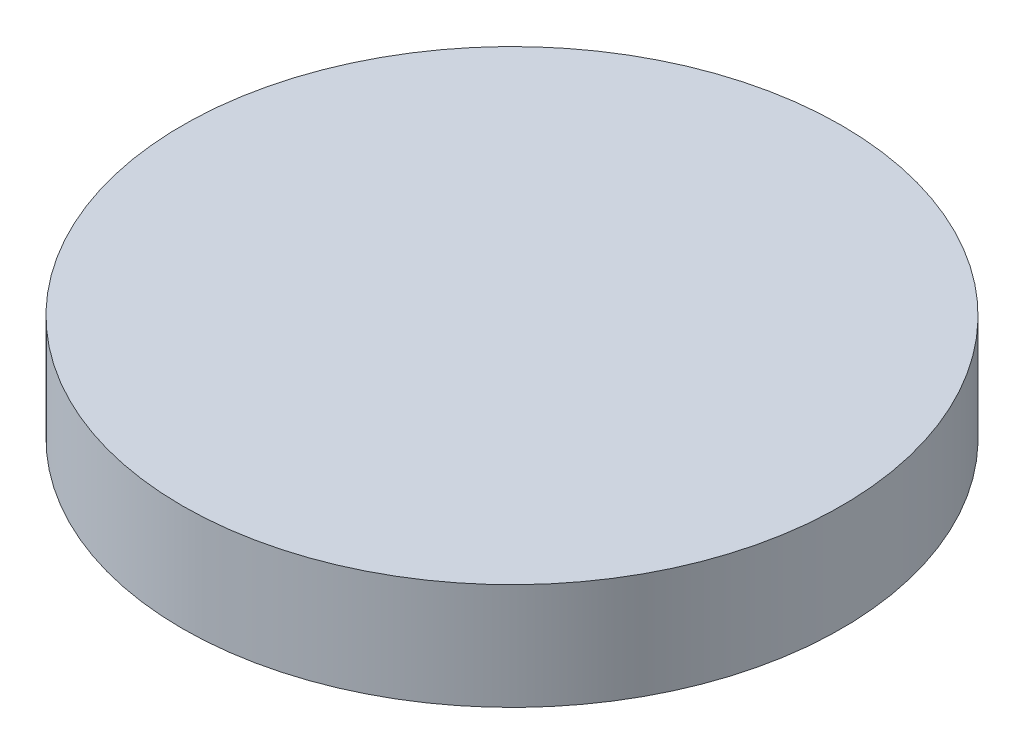
ISO-10303-21;
HEADER;
FILE_DESCRIPTION(('STEP AP214'),'2;1');
FILE_NAME('part.step','',(''),(''),'','','');
FILE_SCHEMA(('AUTOMOTIVE_DESIGN { 1 0 10303 214 1 1 1 1 }'));
ENDSEC;
DATA;
#1=APPLICATION_CONTEXT('core data for automotive mechanical design processes');
#2=APPLICATION_PROTOCOL_DEFINITION('international standard','automotive_design',2000,#1);
#3=PRODUCT_CONTEXT('',#1,'mechanical');
#4=PRODUCT('Part','Part','',(#3));
#5=PRODUCT_RELATED_PRODUCT_CATEGORY('part','',(#4));
#6=PRODUCT_DEFINITION_FORMATION('','',#4);
#7=PRODUCT_DEFINITION_CONTEXT('part definition',#1,'design');
#8=PRODUCT_DEFINITION('design','',#6,#7);
#9=PRODUCT_DEFINITION_SHAPE('','',#8);
#10=(LENGTH_UNIT() NAMED_UNIT(*) SI_UNIT(.MILLI.,.METRE.));
#11=(NAMED_UNIT(*) PLANE_ANGLE_UNIT() SI_UNIT($,.RADIAN.));
#12=(NAMED_UNIT(*) SI_UNIT($,.STERADIAN.) SOLID_ANGLE_UNIT());
#13=UNCERTAINTY_MEASURE_WITH_UNIT(LENGTH_MEASURE(1.E-05),#10,'distance_accuracy_value','');
#14=(GEOMETRIC_REPRESENTATION_CONTEXT(3) GLOBAL_UNCERTAINTY_ASSIGNED_CONTEXT((#13)) GLOBAL_UNIT_ASSIGNED_CONTEXT((#10,
#11,#12)) REPRESENTATION_CONTEXT('',''));
#15=CARTESIAN_POINT('',(0.,0.,0.));
#16=DIRECTION('',(0.,0.,1.));
#17=DIRECTION('',(1.,0.,0.));
#18=AXIS2_PLACEMENT_3D('',#15,#16,#17);
#19=CARTESIAN_POINT('',(0.,20.,0.));
#20=DIRECTION('',(0.,-1.,0.));
#21=DIRECTION('',(0.,0.,-1.));
#22=AXIS2_PLACEMENT_3D('',#19,#20,#21);
#23=CYLINDRICAL_SURFACE('',#22,47.5);
#24=CARTESIAN_POINT('',(0.,20.,0.));
#25=DIRECTION('',(0.,1.,0.));
#26=DIRECTION('',(0.,0.,1.));
#27=AXIS2_PLACEMENT_3D('',#24,#25,#26);
#28=CIRCLE('',#27,47.5);
#29=CARTESIAN_POINT('',(0.,20.,47.5));
#30=VERTEX_POINT('',#29);
#31=EDGE_CURVE('E60',#30,#30,#28,.T.);
#32=ORIENTED_EDGE('',*,*,#31,.T.);
#33=EDGE_LOOP('',(#32));
#34=FACE_BOUND('',#33,.T.);
#35=CARTESIAN_POINT('',(0.,0.,0.));
#36=DIRECTION('',(0.,1.,0.));
#37=DIRECTION('',(0.,0.,1.));
#38=AXIS2_PLACEMENT_3D('',#35,#36,#37);
#39=CIRCLE('',#38,47.5);
#40=CARTESIAN_POINT('',(0.,0.,47.5));
#41=VERTEX_POINT('',#40);
#42=EDGE_CURVE('E58',#41,#41,#39,.T.);
#43=ORIENTED_EDGE('',*,*,#42,.F.);
#44=EDGE_LOOP('',(#43));
#45=FACE_BOUND('',#44,.T.);
#46=ADVANCED_FACE('F45',(#34,#45),#23,.F.);
#47=CARTESIAN_POINT('',(0.,20.,0.));
#48=DIRECTION('',(0.,-1.,0.));
#49=DIRECTION('',(0.,0.,-1.));
#50=AXIS2_PLACEMENT_3D('',#47,#48,#49);
#51=CYLINDRICAL_SURFACE('',#50,52.5);
#52=CARTESIAN_POINT('',(0.,20.,0.));
#53=DIRECTION('',(0.,1.,0.));
#54=DIRECTION('',(0.,0.,1.));
#55=AXIS2_PLACEMENT_3D('',#52,#53,#54);
#56=CIRCLE('',#55,52.5);
#57=CARTESIAN_POINT('',(0.,20.,52.5));
#58=VERTEX_POINT('',#57);
#59=EDGE_CURVE('E11',#58,#58,#56,.T.);
#60=ORIENTED_EDGE('',*,*,#59,.F.);
#61=EDGE_LOOP('',(#60));
#62=FACE_BOUND('',#61,.T.);
#63=CARTESIAN_POINT('',(0.,0.,0.));
#64=DIRECTION('',(0.,1.,0.));
#65=DIRECTION('',(0.,0.,1.));
#66=AXIS2_PLACEMENT_3D('',#63,#64,#65);
#67=CIRCLE('',#66,52.5);
#68=CARTESIAN_POINT('',(0.,0.,52.5));
#69=VERTEX_POINT('',#68);
#70=EDGE_CURVE('E48',#69,#69,#67,.T.);
#71=ORIENTED_EDGE('',*,*,#70,.T.);
#72=EDGE_LOOP('',(#71));
#73=FACE_BOUND('',#72,.T.);
#74=ADVANCED_FACE('F108',(#62,#73),#51,.T.);
#75=CARTESIAN_POINT('',(0.,0.,0.));
#76=DIRECTION('',(0.,1.,0.));
#77=DIRECTION('',(0.,0.,1.));
#78=AXIS2_PLACEMENT_3D('',#75,#76,#77);
#79=PLANE('',#78);
#80=ORIENTED_EDGE('',*,*,#42,.T.);
#81=EDGE_LOOP('',(#80));
#82=FACE_BOUND('',#81,.T.);
#83=ORIENTED_EDGE('',*,*,#70,.F.);
#84=EDGE_LOOP('',(#83));
#85=FACE_BOUND('',#84,.T.);
#86=ADVANCED_FACE('F112',(#82,#85),#79,.F.);
#87=CARTESIAN_POINT('',(0.,20.,0.));
#88=DIRECTION('',(0.,1.,0.));
#89=DIRECTION('',(0.,0.,1.));
#90=AXIS2_PLACEMENT_3D('',#87,#88,#89);
#91=PLANE('',#90);
#92=CARTESIAN_POINT('',(0.,20.,0.));
#93=DIRECTION('',(0.,1.,0.));
#94=DIRECTION('',(0.,0.,1.));
#95=AXIS2_PLACEMENT_3D('',#92,#93,#94);
#96=CIRCLE('',#95,72.5);
#97=CARTESIAN_POINT('',(0.,20.,72.5));
#98=VERTEX_POINT('',#97);
#99=EDGE_CURVE('E73',#98,#98,#96,.T.);
#100=ORIENTED_EDGE('',*,*,#99,.F.);
#101=EDGE_LOOP('',(#100));
#102=FACE_BOUND('',#101,.T.);
#103=ORIENTED_EDGE('',*,*,#59,.T.);
#104=EDGE_LOOP('',(#103));
#105=FACE_BOUND('',#104,.T.);
#106=ADVANCED_FACE('F103',(#102,#105),#91,.F.);
#107=ORIENTED_EDGE('',*,*,#31,.F.);
#108=EDGE_LOOP('',(#107));
#109=FACE_BOUND('',#108,.T.);
#110=ADVANCED_FACE('F94',(#109),#91,.F.);
#111=CARTESIAN_POINT('',(0.,20.,0.));
#112=DIRECTION('',(0.,-1.,0.));
#113=DIRECTION('',(0.,0.,-1.));
#114=AXIS2_PLACEMENT_3D('',#111,#112,#113);
#115=CYLINDRICAL_SURFACE('',#114,72.5);
#116=ORIENTED_EDGE('',*,*,#99,.T.);
#117=EDGE_LOOP('',(#116));
#118=FACE_BOUND('',#117,.T.);
#119=CARTESIAN_POINT('',(0.,0.,0.));
#120=DIRECTION('',(0.,1.,0.));
#121=DIRECTION('',(0.,0.,1.));
#122=AXIS2_PLACEMENT_3D('',#119,#120,#121);
#123=CIRCLE('',#122,72.5);
#124=CARTESIAN_POINT('',(0.,0.,72.5));
#125=VERTEX_POINT('',#124);
#126=EDGE_CURVE('E84',#125,#125,#123,.T.);
#127=ORIENTED_EDGE('',*,*,#126,.F.);
#128=EDGE_LOOP('',(#127));
#129=FACE_BOUND('',#128,.T.);
#130=ADVANCED_FACE('F92',(#118,#129),#115,.F.);
#131=CARTESIAN_POINT('',(0.,0.,0.));
#132=DIRECTION('',(0.,1.,0.));
#133=DIRECTION('',(0.,0.,1.));
#134=AXIS2_PLACEMENT_3D('',#131,#132,#133);
#135=PLANE('',#134);
#136=ORIENTED_EDGE('',*,*,#126,.T.);
#137=EDGE_LOOP('',(#136));
#138=FACE_BOUND('',#137,.T.);
#139=CARTESIAN_POINT('',(0.,0.,0.));
#140=DIRECTION('',(0.,1.,0.));
#141=DIRECTION('',(0.,0.,1.));
#142=AXIS2_PLACEMENT_3D('',#139,#140,#141);
#143=CIRCLE('',#142,77.5);
#144=CARTESIAN_POINT('',(0.,0.,77.5));
#145=VERTEX_POINT('',#144);
#146=EDGE_CURVE('E78',#145,#145,#143,.T.);
#147=ORIENTED_EDGE('',*,*,#146,.F.);
#148=EDGE_LOOP('',(#147));
#149=FACE_BOUND('',#148,.T.);
#150=ADVANCED_FACE('F89',(#138,#149),#135,.F.);
#151=CARTESIAN_POINT('',(0.,25.,0.));
#152=DIRECTION('',(0.,1.,0.));
#153=DIRECTION('',(0.,0.,1.));
#154=AXIS2_PLACEMENT_3D('',#151,#152,#153);
#155=PLANE('',#154);
#156=CARTESIAN_POINT('',(0.,25.,0.));
#157=DIRECTION('',(0.,1.,0.));
#158=DIRECTION('',(0.,0.,1.));
#159=AXIS2_PLACEMENT_3D('',#156,#157,#158);
#160=CIRCLE('',#159,77.5);
#161=CARTESIAN_POINT('',(0.,25.,77.5));
#162=VERTEX_POINT('',#161);
#163=EDGE_CURVE('E68',#162,#162,#160,.T.);
#164=ORIENTED_EDGE('',*,*,#163,.T.);
#165=EDGE_LOOP('',(#164));
#166=FACE_BOUND('',#165,.T.);
#167=ADVANCED_FACE('F101',(#166),#155,.T.);
#168=CARTESIAN_POINT('',(0.,25.,0.));
#169=DIRECTION('',(0.,-1.,0.));
#170=DIRECTION('',(0.,0.,-1.));
#171=AXIS2_PLACEMENT_3D('',#168,#169,#170);
#172=CYLINDRICAL_SURFACE('',#171,77.5);
#173=ORIENTED_EDGE('',*,*,#163,.F.);
#174=EDGE_LOOP('',(#173));
#175=FACE_BOUND('',#174,.T.);
#176=ORIENTED_EDGE('',*,*,#146,.T.);
#177=EDGE_LOOP('',(#176));
#178=FACE_BOUND('',#177,.T.);
#179=ADVANCED_FACE('F121',(#175,#178),#172,.T.);
#180=CLOSED_SHELL('',(#46,#74,#86,#106,#110,#130,#150,#167,#179));
#181=MANIFOLD_SOLID_BREP('B2',#180);
#182=ADVANCED_BREP_SHAPE_REPRESENTATION('',(#18,#181),#14);
#183=SHAPE_DEFINITION_REPRESENTATION(#9,#182);
ENDSEC;
END-ISO-10303-21;
